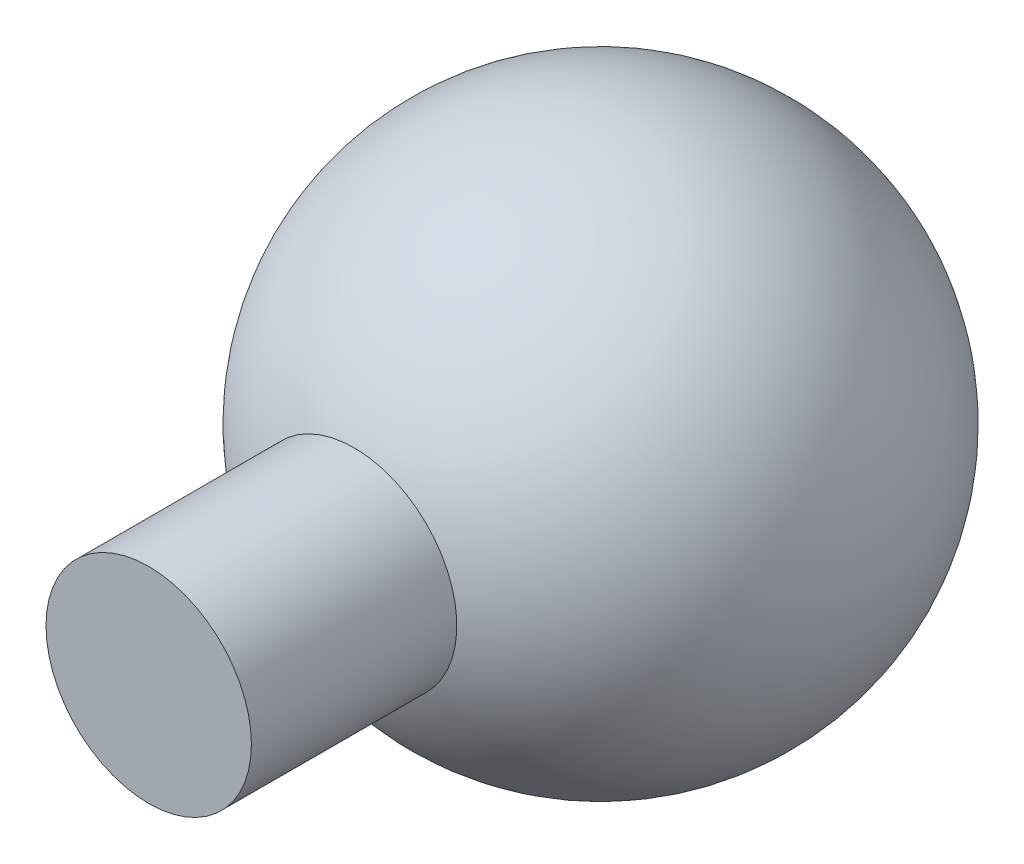
ISO-10303-21;
HEADER;
FILE_DESCRIPTION(('STEP AP214'),'2;1');
FILE_NAME('part.step','',(''),(''),'','','');
FILE_SCHEMA(('AUTOMOTIVE_DESIGN { 1 0 10303 214 1 1 1 1 }'));
ENDSEC;
DATA;
#1=APPLICATION_CONTEXT('core data for automotive mechanical design processes');
#2=APPLICATION_PROTOCOL_DEFINITION('international standard','automotive_design',2000,#1);
#3=PRODUCT_CONTEXT('',#1,'mechanical');
#4=PRODUCT('Part','Part','',(#3));
#5=PRODUCT_RELATED_PRODUCT_CATEGORY('part','',(#4));
#6=PRODUCT_DEFINITION_FORMATION('','',#4);
#7=PRODUCT_DEFINITION_CONTEXT('part definition',#1,'design');
#8=PRODUCT_DEFINITION('design','',#6,#7);
#9=PRODUCT_DEFINITION_SHAPE('','',#8);
#10=(LENGTH_UNIT() NAMED_UNIT(*) SI_UNIT(.MILLI.,.METRE.));
#11=(NAMED_UNIT(*) PLANE_ANGLE_UNIT() SI_UNIT($,.RADIAN.));
#12=(NAMED_UNIT(*) SI_UNIT($,.STERADIAN.) SOLID_ANGLE_UNIT());
#13=UNCERTAINTY_MEASURE_WITH_UNIT(LENGTH_MEASURE(1.E-05),#10,'distance_accuracy_value','');
#14=(GEOMETRIC_REPRESENTATION_CONTEXT(3) GLOBAL_UNCERTAINTY_ASSIGNED_CONTEXT((#13)) GLOBAL_UNIT_ASSIGNED_CONTEXT((#10,
#11,#12)) REPRESENTATION_CONTEXT('',''));
#15=CARTESIAN_POINT('',(0.,0.,0.));
#16=DIRECTION('',(0.,0.,1.));
#17=DIRECTION('',(1.,0.,0.));
#18=AXIS2_PLACEMENT_3D('',#15,#16,#17);
#19=CARTESIAN_POINT('',(0.,0.,0.));
#20=DIRECTION('',(0.,1.,0.));
#21=DIRECTION('',(1.,0.,0.));
#22=AXIS2_PLACEMENT_3D('',#19,#20,#21);
#23=SPHERICAL_SURFACE('',#22,6.5);
#24=CARTESIAN_POINT('',(0.,0.,0.));
#25=DIRECTION('',(0.,0.,-1.));
#26=DIRECTION('',(-1.,0.,0.));
#27=AXIS2_PLACEMENT_3D('',#24,#25,#26);
#28=SPHERICAL_SURFACE('',#27,6.5);
#29=CARTESIAN_POINT('',(0.,0.,6.));
#30=DIRECTION('',(0.,0.,-1.));
#31=DIRECTION('',(-1.,0.,0.));
#32=AXIS2_PLACEMENT_3D('',#29,#30,#31);
#33=CIRCLE('',#32,2.5);
#34=CARTESIAN_POINT('',(-2.5,0.,6.));
#35=VERTEX_POINT('',#34);
#36=EDGE_CURVE('E10',#35,#35,#33,.F.);
#37=ORIENTED_EDGE('',*,*,#36,.F.);
#38=EDGE_LOOP('',(#37));
#39=FACE_BOUND('',#38,.T.);
#40=ADVANCED_FACE('F31',(#39),#28,.T.);
#41=CARTESIAN_POINT('',(0.,0.,11.));
#42=DIRECTION('',(0.,0.,-1.));
#43=DIRECTION('',(-1.,0.,0.));
#44=AXIS2_PLACEMENT_3D('',#41,#42,#43);
#45=CYLINDRICAL_SURFACE('',#44,2.5);
#46=CARTESIAN_POINT('',(0.,0.,11.));
#47=DIRECTION('',(0.,0.,1.));
#48=DIRECTION('',(1.,0.,0.));
#49=AXIS2_PLACEMENT_3D('',#46,#47,#48);
#50=CIRCLE('',#49,2.5);
#51=CARTESIAN_POINT('',(2.5,0.,11.));
#52=VERTEX_POINT('',#51);
#53=EDGE_CURVE('E37',#52,#52,#50,.T.);
#54=ORIENTED_EDGE('',*,*,#53,.F.);
#55=EDGE_LOOP('',(#54));
#56=FACE_BOUND('',#55,.T.);
#57=ORIENTED_EDGE('',*,*,#36,.T.);
#58=EDGE_LOOP('',(#57));
#59=FACE_BOUND('',#58,.T.);
#60=ADVANCED_FACE('F45',(#56,#59),#45,.T.);
#61=CARTESIAN_POINT('',(0.,0.,11.));
#62=DIRECTION('',(0.,0.,1.));
#63=DIRECTION('',(1.,0.,0.));
#64=AXIS2_PLACEMENT_3D('',#61,#62,#63);
#65=PLANE('',#64);
#66=ORIENTED_EDGE('',*,*,#53,.T.);
#67=EDGE_LOOP('',(#66));
#68=FACE_BOUND('',#67,.T.);
#69=ADVANCED_FACE('F43',(#68),#65,.T.);
#70=CLOSED_SHELL('',(#40,#60,#69));
#71=MANIFOLD_SOLID_BREP('B2',#70);
#72=ADVANCED_BREP_SHAPE_REPRESENTATION('',(#18,#71),#14);
#73=SHAPE_DEFINITION_REPRESENTATION(#9,#72);
ENDSEC;
END-ISO-10303-21;
